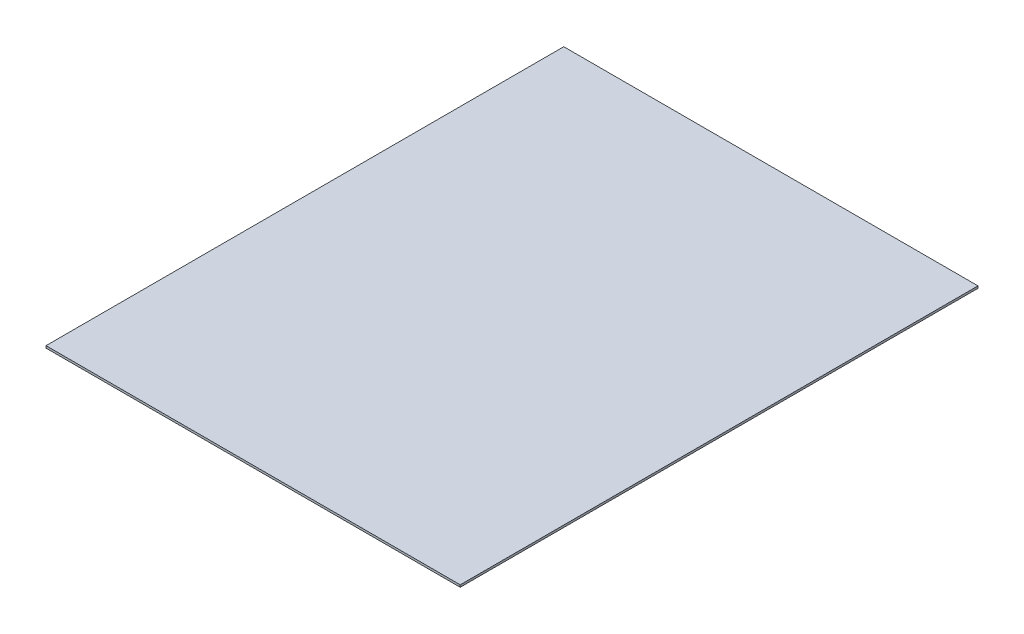
ISO-10303-21;
HEADER;
FILE_DESCRIPTION(('STEP AP214'),'2;1');
FILE_NAME('part.step','',(''),(''),'','','');
FILE_SCHEMA(('AUTOMOTIVE_DESIGN { 1 0 10303 214 1 1 1 1 }'));
ENDSEC;
DATA;
#1=APPLICATION_CONTEXT('core data for automotive mechanical design processes');
#2=APPLICATION_PROTOCOL_DEFINITION('international standard','automotive_design',2000,#1);
#3=PRODUCT_CONTEXT('',#1,'mechanical');
#4=PRODUCT('Part','Part','',(#3));
#5=PRODUCT_RELATED_PRODUCT_CATEGORY('part','',(#4));
#6=PRODUCT_DEFINITION_FORMATION('','',#4);
#7=PRODUCT_DEFINITION_CONTEXT('part definition',#1,'design');
#8=PRODUCT_DEFINITION('design','',#6,#7);
#9=PRODUCT_DEFINITION_SHAPE('','',#8);
#10=(LENGTH_UNIT() NAMED_UNIT(*) SI_UNIT(.MILLI.,.METRE.));
#11=(NAMED_UNIT(*) PLANE_ANGLE_UNIT() SI_UNIT($,.RADIAN.));
#12=(NAMED_UNIT(*) SI_UNIT($,.STERADIAN.) SOLID_ANGLE_UNIT());
#13=UNCERTAINTY_MEASURE_WITH_UNIT(LENGTH_MEASURE(1.E-05),#10,'distance_accuracy_value','');
#14=(GEOMETRIC_REPRESENTATION_CONTEXT(3) GLOBAL_UNCERTAINTY_ASSIGNED_CONTEXT((#13)) GLOBAL_UNIT_ASSIGNED_CONTEXT((#10,
#11,#12)) REPRESENTATION_CONTEXT('',''));
#15=CARTESIAN_POINT('',(0.,0.,0.));
#16=DIRECTION('',(0.,0.,1.));
#17=DIRECTION('',(1.,0.,0.));
#18=AXIS2_PLACEMENT_3D('',#15,#16,#17);
#19=CARTESIAN_POINT('',(609.6,6.35,762.));
#20=DIRECTION('',(-1.,0.,0.));
#21=DIRECTION('',(0.,0.,1.));
#22=AXIS2_PLACEMENT_3D('',#19,#20,#21);
#23=PLANE('',#22);
#24=DIRECTION('',(0.,0.,-1.));
#25=VECTOR('',#24,1.);
#26=CARTESIAN_POINT('',(609.6,0.,762.));
#27=LINE('',#26,#25);
#28=CARTESIAN_POINT('',(609.6,0.,762.));
#29=VERTEX_POINT('',#28);
#30=CARTESIAN_POINT('',(609.6,0.,-762.));
#31=VERTEX_POINT('',#30);
#32=EDGE_CURVE('E107',#29,#31,#27,.T.);
#33=ORIENTED_EDGE('',*,*,#32,.T.);
#34=DIRECTION('',(0.,-1.,0.));
#35=VECTOR('',#34,1.);
#36=CARTESIAN_POINT('',(609.6,6.35,-762.));
#37=LINE('',#36,#35);
#38=CARTESIAN_POINT('',(609.6,6.35,-762.));
#39=VERTEX_POINT('',#38);
#40=EDGE_CURVE('E11',#39,#31,#37,.T.);
#41=ORIENTED_EDGE('',*,*,#40,.F.);
#42=DIRECTION('',(0.,0.,-1.));
#43=VECTOR('',#42,1.);
#44=CARTESIAN_POINT('',(609.6,6.35,762.));
#45=LINE('',#44,#43);
#46=CARTESIAN_POINT('',(609.6,6.35,762.));
#47=VERTEX_POINT('',#46);
#48=EDGE_CURVE('E91',#47,#39,#45,.T.);
#49=ORIENTED_EDGE('',*,*,#48,.F.);
#50=DIRECTION('',(0.,-1.,0.));
#51=VECTOR('',#50,1.);
#52=CARTESIAN_POINT('',(609.6,6.35,762.));
#53=LINE('',#52,#51);
#54=EDGE_CURVE('E103',#47,#29,#53,.T.);
#55=ORIENTED_EDGE('',*,*,#54,.T.);
#56=EDGE_LOOP('',(#33,#41,#49,#55));
#57=FACE_BOUND('',#56,.T.);
#58=ADVANCED_FACE('F39',(#57),#23,.F.);
#59=CARTESIAN_POINT('',(-609.6,6.35,-762.));
#60=DIRECTION('',(0.,0.,1.));
#61=DIRECTION('',(1.,0.,0.));
#62=AXIS2_PLACEMENT_3D('',#59,#60,#61);
#63=PLANE('',#62);
#64=DIRECTION('',(-1.,0.,0.));
#65=VECTOR('',#64,1.);
#66=CARTESIAN_POINT('',(-609.6,0.,-762.));
#67=LINE('',#66,#65);
#68=CARTESIAN_POINT('',(-609.6,0.,-762.));
#69=VERTEX_POINT('',#68);
#70=EDGE_CURVE('E96',#31,#69,#67,.T.);
#71=ORIENTED_EDGE('',*,*,#70,.T.);
#72=DIRECTION('',(0.,-1.,0.));
#73=VECTOR('',#72,1.);
#74=CARTESIAN_POINT('',(-609.6,6.35,-762.));
#75=LINE('',#74,#73);
#76=CARTESIAN_POINT('',(-609.6,6.35,-762.));
#77=VERTEX_POINT('',#76);
#78=EDGE_CURVE('E48',#77,#69,#75,.T.);
#79=ORIENTED_EDGE('',*,*,#78,.F.);
#80=DIRECTION('',(-1.,0.,0.));
#81=VECTOR('',#80,1.);
#82=CARTESIAN_POINT('',(-609.6,6.35,-762.));
#83=LINE('',#82,#81);
#84=EDGE_CURVE('E86',#39,#77,#83,.T.);
#85=ORIENTED_EDGE('',*,*,#84,.F.);
#86=ORIENTED_EDGE('',*,*,#40,.T.);
#87=EDGE_LOOP('',(#71,#79,#85,#86));
#88=FACE_BOUND('',#87,.T.);
#89=ADVANCED_FACE('F95',(#88),#63,.F.);
#90=CARTESIAN_POINT('',(-609.6,6.35,762.));
#91=DIRECTION('',(1.,0.,0.));
#92=DIRECTION('',(0.,0.,-1.));
#93=AXIS2_PLACEMENT_3D('',#90,#91,#92);
#94=PLANE('',#93);
#95=DIRECTION('',(0.,0.,1.));
#96=VECTOR('',#95,1.);
#97=CARTESIAN_POINT('',(-609.6,0.,762.));
#98=LINE('',#97,#96);
#99=CARTESIAN_POINT('',(-609.6,0.,762.));
#100=VERTEX_POINT('',#99);
#101=EDGE_CURVE('E73',#69,#100,#98,.T.);
#102=ORIENTED_EDGE('',*,*,#101,.T.);
#103=DIRECTION('',(0.,-1.,0.));
#104=VECTOR('',#103,1.);
#105=CARTESIAN_POINT('',(-609.6,6.35,762.));
#106=LINE('',#105,#104);
#107=CARTESIAN_POINT('',(-609.6,6.35,762.));
#108=VERTEX_POINT('',#107);
#109=EDGE_CURVE('E98',#108,#100,#106,.T.);
#110=ORIENTED_EDGE('',*,*,#109,.F.);
#111=DIRECTION('',(0.,0.,1.));
#112=VECTOR('',#111,1.);
#113=CARTESIAN_POINT('',(-609.6,6.35,762.));
#114=LINE('',#113,#112);
#115=EDGE_CURVE('E89',#77,#108,#114,.T.);
#116=ORIENTED_EDGE('',*,*,#115,.F.);
#117=ORIENTED_EDGE('',*,*,#78,.T.);
#118=EDGE_LOOP('',(#102,#110,#116,#117));
#119=FACE_BOUND('',#118,.T.);
#120=ADVANCED_FACE('F99',(#119),#94,.F.);
#121=CARTESIAN_POINT('',(-609.6,6.35,762.));
#122=DIRECTION('',(0.,0.,-1.));
#123=DIRECTION('',(-1.,0.,0.));
#124=AXIS2_PLACEMENT_3D('',#121,#122,#123);
#125=PLANE('',#124);
#126=DIRECTION('',(1.,0.,0.));
#127=VECTOR('',#126,1.);
#128=CARTESIAN_POINT('',(-609.6,0.,762.));
#129=LINE('',#128,#127);
#130=EDGE_CURVE('E79',#100,#29,#129,.T.);
#131=ORIENTED_EDGE('',*,*,#130,.T.);
#132=ORIENTED_EDGE('',*,*,#54,.F.);
#133=DIRECTION('',(1.,0.,0.));
#134=VECTOR('',#133,1.);
#135=CARTESIAN_POINT('',(-609.6,6.35,762.));
#136=LINE('',#135,#134);
#137=EDGE_CURVE('E56',#108,#47,#136,.T.);
#138=ORIENTED_EDGE('',*,*,#137,.F.);
#139=ORIENTED_EDGE('',*,*,#109,.T.);
#140=EDGE_LOOP('',(#131,#132,#138,#139));
#141=FACE_BOUND('',#140,.T.);
#142=ADVANCED_FACE('F120',(#141),#125,.F.);
#143=CARTESIAN_POINT('',(0.,6.35,0.));
#144=DIRECTION('',(0.,-1.,0.));
#145=DIRECTION('',(0.,0.,-1.));
#146=AXIS2_PLACEMENT_3D('',#143,#144,#145);
#147=PLANE('',#146);
#148=ORIENTED_EDGE('',*,*,#48,.T.);
#149=ORIENTED_EDGE('',*,*,#84,.T.);
#150=ORIENTED_EDGE('',*,*,#115,.T.);
#151=ORIENTED_EDGE('',*,*,#137,.T.);
#152=EDGE_LOOP('',(#148,#149,#150,#151));
#153=FACE_BOUND('',#152,.T.);
#154=ADVANCED_FACE('F87',(#153),#147,.F.);
#155=CARTESIAN_POINT('',(0.,0.,0.));
#156=DIRECTION('',(0.,-1.,0.));
#157=DIRECTION('',(0.,0.,-1.));
#158=AXIS2_PLACEMENT_3D('',#155,#156,#157);
#159=PLANE('',#158);
#160=ORIENTED_EDGE('',*,*,#32,.F.);
#161=ORIENTED_EDGE('',*,*,#130,.F.);
#162=ORIENTED_EDGE('',*,*,#101,.F.);
#163=ORIENTED_EDGE('',*,*,#70,.F.);
#164=EDGE_LOOP('',(#160,#161,#162,#163));
#165=FACE_BOUND('',#164,.T.);
#166=ADVANCED_FACE('F123',(#165),#159,.T.);
#167=CLOSED_SHELL('',(#58,#89,#120,#142,#154,#166));
#168=MANIFOLD_SOLID_BREP('B2',#167);
#169=ADVANCED_BREP_SHAPE_REPRESENTATION('',(#18,#168),#14);
#170=SHAPE_DEFINITION_REPRESENTATION(#9,#169);
ENDSEC;
END-ISO-10303-21;
